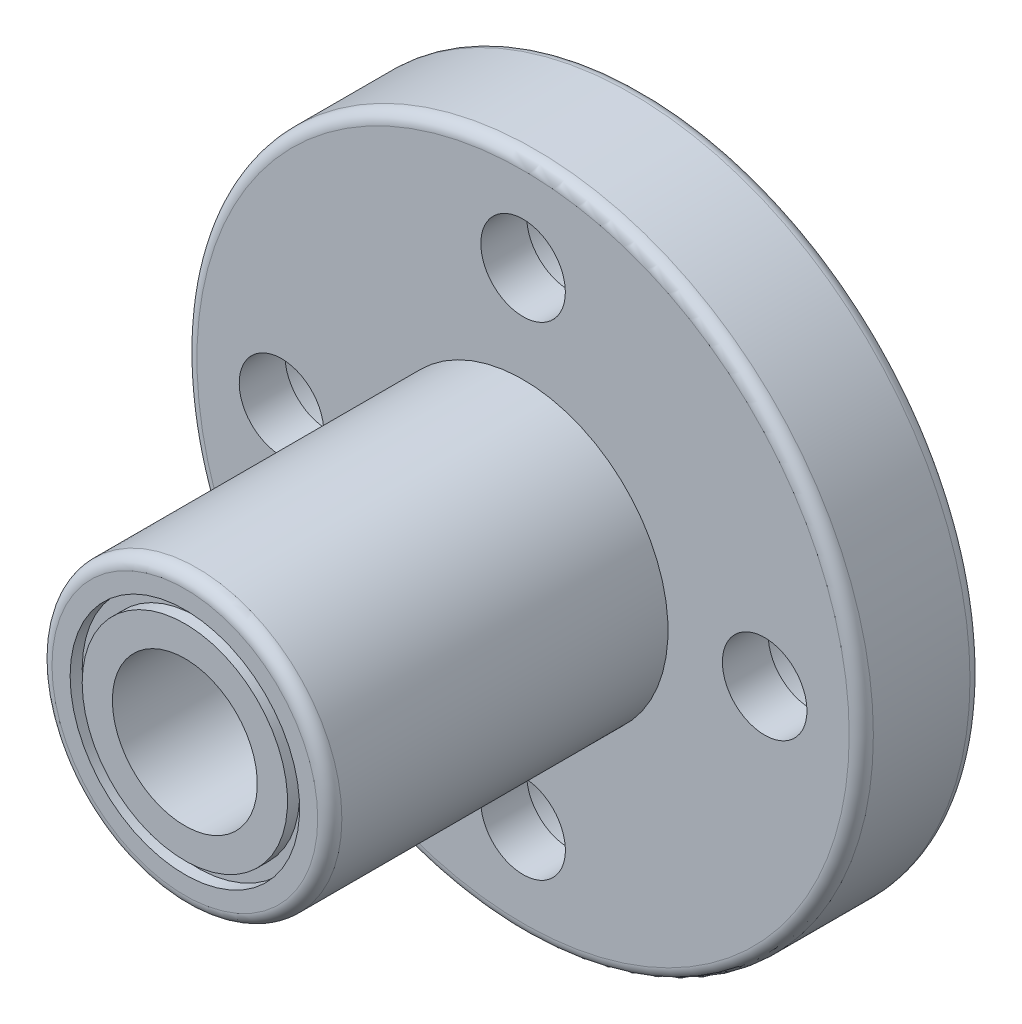
ISO-10303-21;
HEADER;
FILE_DESCRIPTION(('STEP AP214'),'2;1');
FILE_NAME('part.step','',(''),(''),'','','');
FILE_SCHEMA(('AUTOMOTIVE_DESIGN { 1 0 10303 214 1 1 1 1 }'));
ENDSEC;
DATA;
#1=APPLICATION_CONTEXT('core data for automotive mechanical design processes');
#2=APPLICATION_PROTOCOL_DEFINITION('international standard','automotive_design',2000,#1);
#3=PRODUCT_CONTEXT('',#1,'mechanical');
#4=PRODUCT('Part','Part','',(#3));
#5=PRODUCT_RELATED_PRODUCT_CATEGORY('part','',(#4));
#6=PRODUCT_DEFINITION_FORMATION('','',#4);
#7=PRODUCT_DEFINITION_CONTEXT('part definition',#1,'design');
#8=PRODUCT_DEFINITION('design','',#6,#7);
#9=PRODUCT_DEFINITION_SHAPE('','',#8);
#10=(LENGTH_UNIT() NAMED_UNIT(*) SI_UNIT(.MILLI.,.METRE.));
#11=(NAMED_UNIT(*) PLANE_ANGLE_UNIT() SI_UNIT($,.RADIAN.));
#12=(NAMED_UNIT(*) SI_UNIT($,.STERADIAN.) SOLID_ANGLE_UNIT());
#13=UNCERTAINTY_MEASURE_WITH_UNIT(LENGTH_MEASURE(1.E-05),#10,'distance_accuracy_value','');
#14=(GEOMETRIC_REPRESENTATION_CONTEXT(3) GLOBAL_UNCERTAINTY_ASSIGNED_CONTEXT((#13)) GLOBAL_UNIT_ASSIGNED_CONTEXT((#10,
#11,#12)) REPRESENTATION_CONTEXT('',''));
#15=CARTESIAN_POINT('',(0.,0.,0.));
#16=DIRECTION('',(0.,0.,1.));
#17=DIRECTION('',(1.,0.,0.));
#18=AXIS2_PLACEMENT_3D('',#15,#16,#17);
#19=CARTESIAN_POINT('',(0.,-6.,0.));
#20=DIRECTION('',(0.,0.,-1.));
#21=DIRECTION('',(-1.,0.,0.));
#22=AXIS2_PLACEMENT_3D('',#19,#20,#21);
#23=PLANE('',#22);
#24=CARTESIAN_POINT('',(0.,0.,0.));
#25=DIRECTION('',(0.,0.,-1.));
#26=DIRECTION('',(-1.,0.,0.));
#27=AXIS2_PLACEMENT_3D('',#24,#25,#26);
#28=CIRCLE('',#27,13.5);
#29=CARTESIAN_POINT('',(-13.5,0.,0.));
#30=VERTEX_POINT('',#29);
#31=EDGE_CURVE('E71',#30,#30,#28,.T.);
#32=ORIENTED_EDGE('',*,*,#31,.T.);
#33=EDGE_LOOP('',(#32));
#34=FACE_BOUND('',#33,.T.);
#35=CARTESIAN_POINT('',(0.,-10.,0.));
#36=DIRECTION('',(0.,0.,1.));
#37=DIRECTION('',(-1.,0.,0.));
#38=AXIS2_PLACEMENT_3D('',#35,#36,#37);
#39=CIRCLE('',#38,3.);
#40=CARTESIAN_POINT('',(-3.,-10.,0.));
#41=VERTEX_POINT('',#40);
#42=EDGE_CURVE('E165',#41,#41,#39,.T.);
#43=ORIENTED_EDGE('',*,*,#42,.T.);
#44=EDGE_LOOP('',(#43));
#45=FACE_BOUND('',#44,.T.);
#46=CARTESIAN_POINT('',(0.,10.,0.));
#47=DIRECTION('',(0.,0.,1.));
#48=DIRECTION('',(1.,0.,0.));
#49=AXIS2_PLACEMENT_3D('',#46,#47,#48);
#50=CIRCLE('',#49,3.);
#51=CARTESIAN_POINT('',(3.,10.,0.));
#52=VERTEX_POINT('',#51);
#53=EDGE_CURVE('E134',#52,#52,#50,.T.);
#54=ORIENTED_EDGE('',*,*,#53,.T.);
#55=EDGE_LOOP('',(#54));
#56=FACE_BOUND('',#55,.T.);
#57=CARTESIAN_POINT('',(0.,0.,0.));
#58=DIRECTION('',(0.,0.,-1.));
#59=DIRECTION('',(-1.,0.,0.));
#60=AXIS2_PLACEMENT_3D('',#57,#58,#59);
#61=CIRCLE('',#60,6.);
#62=CARTESIAN_POINT('',(-6.,0.,0.));
#63=VERTEX_POINT('',#62);
#64=EDGE_CURVE('E130',#63,#63,#61,.T.);
#65=ORIENTED_EDGE('',*,*,#64,.F.);
#66=EDGE_LOOP('',(#65));
#67=FACE_BOUND('',#66,.T.);
#68=CARTESIAN_POINT('',(10.,0.,0.));
#69=DIRECTION('',(0.,0.,1.));
#70=DIRECTION('',(0.,-1.,0.));
#71=AXIS2_PLACEMENT_3D('',#68,#69,#70);
#72=CIRCLE('',#71,3.);
#73=CARTESIAN_POINT('',(9.99999999999999,-3.00000000000004,0.));
#74=VERTEX_POINT('',#73);
#75=EDGE_CURVE('E149',#74,#74,#72,.T.);
#76=ORIENTED_EDGE('',*,*,#75,.T.);
#77=EDGE_LOOP('',(#76));
#78=FACE_BOUND('',#77,.T.);
#79=CARTESIAN_POINT('',(-10.,1.04744440165294E-13,0.));
#80=DIRECTION('',(0.,0.,1.));
#81=DIRECTION('',(0.,1.,0.));
#82=AXIS2_PLACEMENT_3D('',#79,#80,#81);
#83=CIRCLE('',#82,3.);
#84=CARTESIAN_POINT('',(-9.99999999999997,3.00000000000011,0.));
#85=VERTEX_POINT('',#84);
#86=EDGE_CURVE('E180',#85,#85,#83,.T.);
#87=ORIENTED_EDGE('',*,*,#86,.T.);
#88=EDGE_LOOP('',(#87));
#89=FACE_BOUND('',#88,.T.);
#90=ADVANCED_FACE('F40',(#34,#45,#56,#67,#78,#89),#23,.T.);
#91=CARTESIAN_POINT('',(0.,-14.,5.));
#92=DIRECTION('',(0.,0.,1.));
#93=DIRECTION('',(1.,0.,0.));
#94=AXIS2_PLACEMENT_3D('',#91,#92,#93);
#95=PLANE('',#94);
#96=CARTESIAN_POINT('',(0.,0.,5.));
#97=DIRECTION('',(0.,0.,1.));
#98=DIRECTION('',(1.,0.,0.));
#99=AXIS2_PLACEMENT_3D('',#96,#97,#98);
#100=CIRCLE('',#99,13.5);
#101=CARTESIAN_POINT('',(13.5,0.,5.));
#102=VERTEX_POINT('',#101);
#103=EDGE_CURVE('E55',#102,#102,#100,.T.);
#104=ORIENTED_EDGE('',*,*,#103,.T.);
#105=EDGE_LOOP('',(#104));
#106=FACE_BOUND('',#105,.T.);
#107=CARTESIAN_POINT('',(0.,-10.,5.));
#108=DIRECTION('',(0.,0.,1.));
#109=DIRECTION('',(-1.,0.,0.));
#110=AXIS2_PLACEMENT_3D('',#107,#108,#109);
#111=CIRCLE('',#110,1.75);
#112=CARTESIAN_POINT('',(-1.75,-10.,5.));
#113=VERTEX_POINT('',#112);
#114=EDGE_CURVE('E177',#113,#113,#111,.T.);
#115=ORIENTED_EDGE('',*,*,#114,.F.);
#116=EDGE_LOOP('',(#115));
#117=FACE_BOUND('',#116,.T.);
#118=CARTESIAN_POINT('',(0.,10.,5.));
#119=DIRECTION('',(0.,0.,1.));
#120=DIRECTION('',(1.,0.,0.));
#121=AXIS2_PLACEMENT_3D('',#118,#119,#120);
#122=CIRCLE('',#121,1.75);
#123=CARTESIAN_POINT('',(1.75,10.,5.));
#124=VERTEX_POINT('',#123);
#125=EDGE_CURVE('E145',#124,#124,#122,.T.);
#126=ORIENTED_EDGE('',*,*,#125,.F.);
#127=EDGE_LOOP('',(#126));
#128=FACE_BOUND('',#127,.T.);
#129=CARTESIAN_POINT('',(0.,0.,5.));
#130=DIRECTION('',(0.,0.,-1.));
#131=DIRECTION('',(-1.,0.,0.));
#132=AXIS2_PLACEMENT_3D('',#129,#130,#131);
#133=CIRCLE('',#132,6.);
#134=CARTESIAN_POINT('',(-6.,0.,5.));
#135=VERTEX_POINT('',#134);
#136=EDGE_CURVE('E75',#135,#135,#133,.T.);
#137=ORIENTED_EDGE('',*,*,#136,.T.);
#138=EDGE_LOOP('',(#137));
#139=FACE_BOUND('',#138,.T.);
#140=CARTESIAN_POINT('',(10.,0.,5.));
#141=DIRECTION('',(0.,0.,1.));
#142=DIRECTION('',(0.,-1.,0.));
#143=AXIS2_PLACEMENT_3D('',#140,#141,#142);
#144=CIRCLE('',#143,1.75);
#145=CARTESIAN_POINT('',(9.99999999999999,-1.75000000000003,5.));
#146=VERTEX_POINT('',#145);
#147=EDGE_CURVE('E161',#146,#146,#144,.T.);
#148=ORIENTED_EDGE('',*,*,#147,.F.);
#149=EDGE_LOOP('',(#148));
#150=FACE_BOUND('',#149,.T.);
#151=CARTESIAN_POINT('',(-10.,1.04744440165294E-13,5.));
#152=DIRECTION('',(0.,0.,1.));
#153=DIRECTION('',(0.,1.,0.));
#154=AXIS2_PLACEMENT_3D('',#151,#152,#153);
#155=CIRCLE('',#154,1.75);
#156=CARTESIAN_POINT('',(-9.99999999999998,1.7500000000001,5.));
#157=VERTEX_POINT('',#156);
#158=EDGE_CURVE('E192',#157,#157,#155,.T.);
#159=ORIENTED_EDGE('',*,*,#158,.F.);
#160=EDGE_LOOP('',(#159));
#161=FACE_BOUND('',#160,.T.);
#162=ADVANCED_FACE('F200',(#106,#117,#128,#139,#150,#161),#95,.T.);
#163=CARTESIAN_POINT('',(0.,0.,0.));
#164=DIRECTION('',(0.,0.,-1.));
#165=DIRECTION('',(-1.,0.,0.));
#166=AXIS2_PLACEMENT_3D('',#163,#164,#165);
#167=CYLINDRICAL_SURFACE('',#166,14.);
#168=CARTESIAN_POINT('',(0.,0.,0.5));
#169=DIRECTION('',(0.,0.,-1.));
#170=DIRECTION('',(-1.,0.,0.));
#171=AXIS2_PLACEMENT_3D('',#168,#169,#170);
#172=CIRCLE('',#171,14.);
#173=CARTESIAN_POINT('',(-14.,0.,0.5));
#174=VERTEX_POINT('',#173);
#175=EDGE_CURVE('E61',#174,#174,#172,.F.);
#176=ORIENTED_EDGE('',*,*,#175,.T.);
#177=EDGE_LOOP('',(#176));
#178=FACE_BOUND('',#177,.T.);
#179=CARTESIAN_POINT('',(0.,0.,4.5));
#180=DIRECTION('',(0.,0.,1.));
#181=DIRECTION('',(1.,0.,0.));
#182=AXIS2_PLACEMENT_3D('',#179,#180,#181);
#183=CIRCLE('',#182,14.);
#184=CARTESIAN_POINT('',(14.,0.,4.5));
#185=VERTEX_POINT('',#184);
#186=EDGE_CURVE('E67',#185,#185,#183,.F.);
#187=ORIENTED_EDGE('',*,*,#186,.T.);
#188=EDGE_LOOP('',(#187));
#189=FACE_BOUND('',#188,.T.);
#190=ADVANCED_FACE('F202',(#178,#189),#167,.T.);
#191=CARTESIAN_POINT('',(0.,0.,0.));
#192=DIRECTION('',(0.,0.,-1.));
#193=DIRECTION('',(-1.,0.,0.));
#194=AXIS2_PLACEMENT_3D('',#191,#192,#193);
#195=CYLINDRICAL_SURFACE('',#194,6.);
#196=CARTESIAN_POINT('',(0.,0.,18.5));
#197=DIRECTION('',(0.,0.,1.));
#198=DIRECTION('',(1.,0.,0.));
#199=AXIS2_PLACEMENT_3D('',#196,#197,#198);
#200=CIRCLE('',#199,6.);
#201=CARTESIAN_POINT('',(6.,0.,18.5));
#202=VERTEX_POINT('',#201);
#203=EDGE_CURVE('E48',#202,#202,#200,.F.);
#204=ORIENTED_EDGE('',*,*,#203,.T.);
#205=EDGE_LOOP('',(#204));
#206=FACE_BOUND('',#205,.T.);
#207=ORIENTED_EDGE('',*,*,#136,.F.);
#208=EDGE_LOOP('',(#207));
#209=FACE_BOUND('',#208,.T.);
#210=ADVANCED_FACE('F209',(#206,#209),#195,.T.);
#211=CARTESIAN_POINT('',(0.,-6.,19.));
#212=DIRECTION('',(0.,0.,1.));
#213=DIRECTION('',(1.,0.,0.));
#214=AXIS2_PLACEMENT_3D('',#211,#212,#213);
#215=PLANE('',#214);
#216=CARTESIAN_POINT('',(0.,0.,19.));
#217=DIRECTION('',(0.,0.,1.));
#218=DIRECTION('',(1.,0.,0.));
#219=AXIS2_PLACEMENT_3D('',#216,#217,#218);
#220=CIRCLE('',#219,5.5);
#221=CARTESIAN_POINT('',(5.5,0.,19.));
#222=VERTEX_POINT('',#221);
#223=EDGE_CURVE('E10',#222,#222,#220,.T.);
#224=ORIENTED_EDGE('',*,*,#223,.T.);
#225=EDGE_LOOP('',(#224));
#226=FACE_BOUND('',#225,.T.);
#227=CARTESIAN_POINT('',(0.,0.,19.));
#228=DIRECTION('',(0.,0.,-1.));
#229=DIRECTION('',(-1.,0.,0.));
#230=AXIS2_PLACEMENT_3D('',#227,#228,#229);
#231=CIRCLE('',#230,4.75);
#232=CARTESIAN_POINT('',(-4.75,0.,19.));
#233=VERTEX_POINT('',#232);
#234=EDGE_CURVE('E78',#233,#233,#231,.T.);
#235=ORIENTED_EDGE('',*,*,#234,.T.);
#236=EDGE_LOOP('',(#235));
#237=FACE_BOUND('',#236,.T.);
#238=ADVANCED_FACE('F466',(#226,#237),#215,.T.);
#239=CARTESIAN_POINT('',(0.,0.,0.));
#240=DIRECTION('',(0.,0.,-1.));
#241=DIRECTION('',(-1.,0.,0.));
#242=AXIS2_PLACEMENT_3D('',#239,#240,#241);
#243=CYLINDRICAL_SURFACE('',#242,4.75);
#244=CARTESIAN_POINT('',(0.,0.,18.5));
#245=DIRECTION('',(0.,0.,-1.));
#246=DIRECTION('',(-1.,0.,0.));
#247=AXIS2_PLACEMENT_3D('',#244,#245,#246);
#248=CIRCLE('',#247,4.75);
#249=CARTESIAN_POINT('',(-4.75,0.,18.5));
#250=VERTEX_POINT('',#249);
#251=EDGE_CURVE('E82',#250,#250,#248,.T.);
#252=ORIENTED_EDGE('',*,*,#251,.T.);
#253=EDGE_LOOP('',(#252));
#254=FACE_BOUND('',#253,.T.);
#255=ORIENTED_EDGE('',*,*,#234,.F.);
#256=EDGE_LOOP('',(#255));
#257=FACE_BOUND('',#256,.T.);
#258=ADVANCED_FACE('F457',(#254,#257),#243,.F.);
#259=CARTESIAN_POINT('',(0.,-4.75,18.5));
#260=DIRECTION('',(0.,0.,1.));
#261=DIRECTION('',(1.,0.,0.));
#262=AXIS2_PLACEMENT_3D('',#259,#260,#261);
#263=PLANE('',#262);
#264=CARTESIAN_POINT('',(0.,0.,18.5));
#265=DIRECTION('',(0.,0.,-1.));
#266=DIRECTION('',(-1.,0.,0.));
#267=AXIS2_PLACEMENT_3D('',#264,#265,#266);
#268=CIRCLE('',#267,4.25);
#269=CARTESIAN_POINT('',(-4.25,0.,18.5));
#270=VERTEX_POINT('',#269);
#271=EDGE_CURVE('E86',#270,#270,#268,.T.);
#272=ORIENTED_EDGE('',*,*,#271,.T.);
#273=EDGE_LOOP('',(#272));
#274=FACE_BOUND('',#273,.T.);
#275=ORIENTED_EDGE('',*,*,#251,.F.);
#276=EDGE_LOOP('',(#275));
#277=FACE_BOUND('',#276,.T.);
#278=ADVANCED_FACE('F448',(#274,#277),#263,.T.);
#279=CARTESIAN_POINT('',(0.,0.,0.));
#280=DIRECTION('',(0.,0.,-1.));
#281=DIRECTION('',(-1.,0.,0.));
#282=AXIS2_PLACEMENT_3D('',#279,#280,#281);
#283=CYLINDRICAL_SURFACE('',#282,4.25);
#284=CARTESIAN_POINT('',(0.,0.,19.));
#285=DIRECTION('',(0.,0.,-1.));
#286=DIRECTION('',(-1.,0.,0.));
#287=AXIS2_PLACEMENT_3D('',#284,#285,#286);
#288=CIRCLE('',#287,4.25);
#289=CARTESIAN_POINT('',(-4.25,0.,19.));
#290=VERTEX_POINT('',#289);
#291=EDGE_CURVE('E90',#290,#290,#288,.T.);
#292=ORIENTED_EDGE('',*,*,#291,.T.);
#293=EDGE_LOOP('',(#292));
#294=FACE_BOUND('',#293,.T.);
#295=ORIENTED_EDGE('',*,*,#271,.F.);
#296=EDGE_LOOP('',(#295));
#297=FACE_BOUND('',#296,.T.);
#298=ADVANCED_FACE('F440',(#294,#297),#283,.T.);
#299=CARTESIAN_POINT('',(0.,-4.25,19.));
#300=DIRECTION('',(0.,0.,1.));
#301=DIRECTION('',(1.,0.,0.));
#302=AXIS2_PLACEMENT_3D('',#299,#300,#301);
#303=PLANE('',#302);
#304=CARTESIAN_POINT('',(0.,0.,19.));
#305=DIRECTION('',(0.,0.,-1.));
#306=DIRECTION('',(-1.,0.,0.));
#307=AXIS2_PLACEMENT_3D('',#304,#305,#306);
#308=CIRCLE('',#307,3.);
#309=CARTESIAN_POINT('',(-3.,0.,19.));
#310=VERTEX_POINT('',#309);
#311=EDGE_CURVE('E94',#310,#310,#308,.T.);
#312=ORIENTED_EDGE('',*,*,#311,.T.);
#313=EDGE_LOOP('',(#312));
#314=FACE_BOUND('',#313,.T.);
#315=ORIENTED_EDGE('',*,*,#291,.F.);
#316=EDGE_LOOP('',(#315));
#317=FACE_BOUND('',#316,.T.);
#318=ADVANCED_FACE('F432',(#314,#317),#303,.T.);
#319=CARTESIAN_POINT('',(0.,0.,0.));
#320=DIRECTION('',(0.,0.,-1.));
#321=DIRECTION('',(-1.,0.,0.));
#322=AXIS2_PLACEMENT_3D('',#319,#320,#321);
#323=CYLINDRICAL_SURFACE('',#322,3.);
#324=CARTESIAN_POINT('',(0.,0.,0.));
#325=DIRECTION('',(0.,0.,-1.));
#326=DIRECTION('',(-1.,0.,0.));
#327=AXIS2_PLACEMENT_3D('',#324,#325,#326);
#328=CIRCLE('',#327,3.);
#329=CARTESIAN_POINT('',(-3.,0.,0.));
#330=VERTEX_POINT('',#329);
#331=EDGE_CURVE('E98',#330,#330,#328,.T.);
#332=ORIENTED_EDGE('',*,*,#331,.T.);
#333=EDGE_LOOP('',(#332));
#334=FACE_BOUND('',#333,.T.);
#335=ORIENTED_EDGE('',*,*,#311,.F.);
#336=EDGE_LOOP('',(#335));
#337=FACE_BOUND('',#336,.T.);
#338=ADVANCED_FACE('F423',(#334,#337),#323,.F.);
#339=CARTESIAN_POINT('',(0.,-3.,0.));
#340=DIRECTION('',(0.,0.,-1.));
#341=DIRECTION('',(-1.,0.,0.));
#342=AXIS2_PLACEMENT_3D('',#339,#340,#341);
#343=PLANE('',#342);
#344=CARTESIAN_POINT('',(0.,0.,0.));
#345=DIRECTION('',(0.,0.,-1.));
#346=DIRECTION('',(-1.,0.,0.));
#347=AXIS2_PLACEMENT_3D('',#344,#345,#346);
#348=CIRCLE('',#347,4.25);
#349=CARTESIAN_POINT('',(-4.25,0.,0.));
#350=VERTEX_POINT('',#349);
#351=EDGE_CURVE('E102',#350,#350,#348,.T.);
#352=ORIENTED_EDGE('',*,*,#351,.T.);
#353=EDGE_LOOP('',(#352));
#354=FACE_BOUND('',#353,.T.);
#355=ORIENTED_EDGE('',*,*,#331,.F.);
#356=EDGE_LOOP('',(#355));
#357=FACE_BOUND('',#356,.T.);
#358=ADVANCED_FACE('F414',(#354,#357),#343,.T.);
#359=CARTESIAN_POINT('',(0.,0.,0.));
#360=DIRECTION('',(0.,0.,-1.));
#361=DIRECTION('',(-1.,0.,0.));
#362=AXIS2_PLACEMENT_3D('',#359,#360,#361);
#363=CYLINDRICAL_SURFACE('',#362,4.25);
#364=CARTESIAN_POINT('',(0.,0.,0.5));
#365=DIRECTION('',(0.,0.,-1.));
#366=DIRECTION('',(-1.,0.,0.));
#367=AXIS2_PLACEMENT_3D('',#364,#365,#366);
#368=CIRCLE('',#367,4.25);
#369=CARTESIAN_POINT('',(-4.25,0.,0.5));
#370=VERTEX_POINT('',#369);
#371=EDGE_CURVE('E106',#370,#370,#368,.T.);
#372=ORIENTED_EDGE('',*,*,#371,.T.);
#373=EDGE_LOOP('',(#372));
#374=FACE_BOUND('',#373,.T.);
#375=ORIENTED_EDGE('',*,*,#351,.F.);
#376=EDGE_LOOP('',(#375));
#377=FACE_BOUND('',#376,.T.);
#378=ADVANCED_FACE('F405',(#374,#377),#363,.T.);
#379=CARTESIAN_POINT('',(0.,-4.75,0.5));
#380=DIRECTION('',(0.,0.,-1.));
#381=DIRECTION('',(-1.,0.,0.));
#382=AXIS2_PLACEMENT_3D('',#379,#380,#381);
#383=PLANE('',#382);
#384=CARTESIAN_POINT('',(0.,0.,0.5));
#385=DIRECTION('',(0.,0.,-1.));
#386=DIRECTION('',(-1.,0.,0.));
#387=AXIS2_PLACEMENT_3D('',#384,#385,#386);
#388=CIRCLE('',#387,4.75);
#389=CARTESIAN_POINT('',(-4.75,0.,0.5));
#390=VERTEX_POINT('',#389);
#391=EDGE_CURVE('E110',#390,#390,#388,.T.);
#392=ORIENTED_EDGE('',*,*,#391,.T.);
#393=EDGE_LOOP('',(#392));
#394=FACE_BOUND('',#393,.T.);
#395=ORIENTED_EDGE('',*,*,#371,.F.);
#396=EDGE_LOOP('',(#395));
#397=FACE_BOUND('',#396,.T.);
#398=ADVANCED_FACE('F396',(#394,#397),#383,.T.);
#399=CARTESIAN_POINT('',(0.,0.,0.));
#400=DIRECTION('',(0.,0.,-1.));
#401=DIRECTION('',(-1.,0.,0.));
#402=AXIS2_PLACEMENT_3D('',#399,#400,#401);
#403=CYLINDRICAL_SURFACE('',#402,4.75);
#404=CARTESIAN_POINT('',(0.,0.,0.));
#405=DIRECTION('',(0.,0.,-1.));
#406=DIRECTION('',(-1.,0.,0.));
#407=AXIS2_PLACEMENT_3D('',#404,#405,#406);
#408=CIRCLE('',#407,4.75);
#409=CARTESIAN_POINT('',(-4.75,0.,0.));
#410=VERTEX_POINT('',#409);
#411=EDGE_CURVE('E114',#410,#410,#408,.T.);
#412=ORIENTED_EDGE('',*,*,#411,.T.);
#413=EDGE_LOOP('',(#412));
#414=FACE_BOUND('',#413,.T.);
#415=ORIENTED_EDGE('',*,*,#391,.F.);
#416=EDGE_LOOP('',(#415));
#417=FACE_BOUND('',#416,.T.);
#418=ADVANCED_FACE('F387',(#414,#417),#403,.F.);
#419=CARTESIAN_POINT('',(0.,-4.75,0.));
#420=DIRECTION('',(0.,0.,-1.));
#421=DIRECTION('',(-1.,0.,0.));
#422=AXIS2_PLACEMENT_3D('',#419,#420,#421);
#423=PLANE('',#422);
#424=CARTESIAN_POINT('',(0.,0.,0.));
#425=DIRECTION('',(0.,0.,-1.));
#426=DIRECTION('',(-1.,0.,0.));
#427=AXIS2_PLACEMENT_3D('',#424,#425,#426);
#428=CIRCLE('',#427,5.5);
#429=CARTESIAN_POINT('',(-5.5,0.,0.));
#430=VERTEX_POINT('',#429);
#431=EDGE_CURVE('E118',#430,#430,#428,.T.);
#432=ORIENTED_EDGE('',*,*,#431,.T.);
#433=EDGE_LOOP('',(#432));
#434=FACE_BOUND('',#433,.T.);
#435=ORIENTED_EDGE('',*,*,#411,.F.);
#436=EDGE_LOOP('',(#435));
#437=FACE_BOUND('',#436,.T.);
#438=ADVANCED_FACE('F378',(#434,#437),#423,.T.);
#439=CARTESIAN_POINT('',(0.,0.,0.));
#440=DIRECTION('',(0.,0.,-1.));
#441=DIRECTION('',(-1.,0.,0.));
#442=AXIS2_PLACEMENT_3D('',#439,#440,#441);
#443=CYLINDRICAL_SURFACE('',#442,5.5);
#444=CARTESIAN_POINT('',(0.,0.,0.499999999999999));
#445=DIRECTION('',(0.,0.,-1.));
#446=DIRECTION('',(-1.,0.,0.));
#447=AXIS2_PLACEMENT_3D('',#444,#445,#446);
#448=CIRCLE('',#447,5.5);
#449=CARTESIAN_POINT('',(-5.5,0.,0.499999999999999));
#450=VERTEX_POINT('',#449);
#451=EDGE_CURVE('E122',#450,#450,#448,.T.);
#452=ORIENTED_EDGE('',*,*,#451,.T.);
#453=EDGE_LOOP('',(#452));
#454=FACE_BOUND('',#453,.T.);
#455=ORIENTED_EDGE('',*,*,#431,.F.);
#456=EDGE_LOOP('',(#455));
#457=FACE_BOUND('',#456,.T.);
#458=ADVANCED_FACE('F369',(#454,#457),#443,.T.);
#459=CARTESIAN_POINT('',(0.,-6.,0.5));
#460=DIRECTION('',(0.,0.,-1.));
#461=DIRECTION('',(-1.,0.,0.));
#462=AXIS2_PLACEMENT_3D('',#459,#460,#461);
#463=PLANE('',#462);
#464=CARTESIAN_POINT('',(0.,0.,0.5));
#465=DIRECTION('',(0.,0.,-1.));
#466=DIRECTION('',(-1.,0.,0.));
#467=AXIS2_PLACEMENT_3D('',#464,#465,#466);
#468=CIRCLE('',#467,6.);
#469=CARTESIAN_POINT('',(-6.,0.,0.5));
#470=VERTEX_POINT('',#469);
#471=EDGE_CURVE('E126',#470,#470,#468,.T.);
#472=ORIENTED_EDGE('',*,*,#471,.T.);
#473=EDGE_LOOP('',(#472));
#474=FACE_BOUND('',#473,.T.);
#475=ORIENTED_EDGE('',*,*,#451,.F.);
#476=EDGE_LOOP('',(#475));
#477=FACE_BOUND('',#476,.T.);
#478=ADVANCED_FACE('F360',(#474,#477),#463,.T.);
#479=CARTESIAN_POINT('',(0.,0.,0.));
#480=DIRECTION('',(0.,0.,-1.));
#481=DIRECTION('',(-1.,0.,0.));
#482=AXIS2_PLACEMENT_3D('',#479,#480,#481);
#483=CYLINDRICAL_SURFACE('',#482,6.);
#484=ORIENTED_EDGE('',*,*,#64,.T.);
#485=EDGE_LOOP('',(#484));
#486=FACE_BOUND('',#485,.T.);
#487=ORIENTED_EDGE('',*,*,#471,.F.);
#488=EDGE_LOOP('',(#487));
#489=FACE_BOUND('',#488,.T.);
#490=ADVANCED_FACE('F351',(#486,#489),#483,.F.);
#491=CARTESIAN_POINT('',(0.,10.,0.));
#492=DIRECTION('',(0.,0.,1.));
#493=DIRECTION('',(1.,0.,0.));
#494=AXIS2_PLACEMENT_3D('',#491,#492,#493);
#495=CYLINDRICAL_SURFACE('',#494,3.);
#496=CARTESIAN_POINT('',(0.,10.,3.1));
#497=DIRECTION('',(0.,0.,1.));
#498=DIRECTION('',(1.,0.,0.));
#499=AXIS2_PLACEMENT_3D('',#496,#497,#498);
#500=CIRCLE('',#499,3.);
#501=CARTESIAN_POINT('',(3.,10.,3.1));
#502=VERTEX_POINT('',#501);
#503=EDGE_CURVE('E138',#502,#502,#500,.T.);
#504=ORIENTED_EDGE('',*,*,#503,.T.);
#505=EDGE_LOOP('',(#504));
#506=FACE_BOUND('',#505,.T.);
#507=ORIENTED_EDGE('',*,*,#53,.F.);
#508=EDGE_LOOP('',(#507));
#509=FACE_BOUND('',#508,.T.);
#510=ADVANCED_FACE('F342',(#506,#509),#495,.F.);
#511=CARTESIAN_POINT('',(0.,13.,3.1));
#512=DIRECTION('',(0.,0.,-1.));
#513=DIRECTION('',(-1.,0.,0.));
#514=AXIS2_PLACEMENT_3D('',#511,#512,#513);
#515=PLANE('',#514);
#516=CARTESIAN_POINT('',(0.,10.,3.1));
#517=DIRECTION('',(0.,0.,1.));
#518=DIRECTION('',(1.,0.,0.));
#519=AXIS2_PLACEMENT_3D('',#516,#517,#518);
#520=CIRCLE('',#519,1.75);
#521=CARTESIAN_POINT('',(1.75,10.,3.1));
#522=VERTEX_POINT('',#521);
#523=EDGE_CURVE('E141',#522,#522,#520,.T.);
#524=ORIENTED_EDGE('',*,*,#523,.T.);
#525=EDGE_LOOP('',(#524));
#526=FACE_BOUND('',#525,.T.);
#527=ORIENTED_EDGE('',*,*,#503,.F.);
#528=EDGE_LOOP('',(#527));
#529=FACE_BOUND('',#528,.T.);
#530=ADVANCED_FACE('F333',(#526,#529),#515,.T.);
#531=CARTESIAN_POINT('',(0.,10.,0.));
#532=DIRECTION('',(0.,0.,1.));
#533=DIRECTION('',(1.,0.,0.));
#534=AXIS2_PLACEMENT_3D('',#531,#532,#533);
#535=CYLINDRICAL_SURFACE('',#534,1.75);
#536=ORIENTED_EDGE('',*,*,#125,.T.);
#537=EDGE_LOOP('',(#536));
#538=FACE_BOUND('',#537,.T.);
#539=ORIENTED_EDGE('',*,*,#523,.F.);
#540=EDGE_LOOP('',(#539));
#541=FACE_BOUND('',#540,.T.);
#542=ADVANCED_FACE('F324',(#538,#541),#535,.F.);
#543=CARTESIAN_POINT('',(10.,0.,0.));
#544=DIRECTION('',(0.,0.,1.));
#545=DIRECTION('',(0.,-1.,0.));
#546=AXIS2_PLACEMENT_3D('',#543,#544,#545);
#547=CYLINDRICAL_SURFACE('',#546,3.);
#548=CARTESIAN_POINT('',(10.,0.,3.1));
#549=DIRECTION('',(0.,0.,1.));
#550=DIRECTION('',(0.,-1.,0.));
#551=AXIS2_PLACEMENT_3D('',#548,#549,#550);
#552=CIRCLE('',#551,3.);
#553=CARTESIAN_POINT('',(9.99999999999999,-3.00000000000004,3.1));
#554=VERTEX_POINT('',#553);
#555=EDGE_CURVE('E153',#554,#554,#552,.T.);
#556=ORIENTED_EDGE('',*,*,#555,.T.);
#557=EDGE_LOOP('',(#556));
#558=FACE_BOUND('',#557,.T.);
#559=ORIENTED_EDGE('',*,*,#75,.F.);
#560=EDGE_LOOP('',(#559));
#561=FACE_BOUND('',#560,.T.);
#562=ADVANCED_FACE('F315',(#558,#561),#547,.F.);
#563=CARTESIAN_POINT('',(13.,0.,3.1));
#564=DIRECTION('',(0.,0.,-1.));
#565=DIRECTION('',(0.,1.,0.));
#566=AXIS2_PLACEMENT_3D('',#563,#564,#565);
#567=PLANE('',#566);
#568=CARTESIAN_POINT('',(10.,0.,3.1));
#569=DIRECTION('',(0.,0.,1.));
#570=DIRECTION('',(0.,-1.,0.));
#571=AXIS2_PLACEMENT_3D('',#568,#569,#570);
#572=CIRCLE('',#571,1.75);
#573=CARTESIAN_POINT('',(9.99999999999999,-1.75000000000003,3.1));
#574=VERTEX_POINT('',#573);
#575=EDGE_CURVE('E157',#574,#574,#572,.T.);
#576=ORIENTED_EDGE('',*,*,#575,.T.);
#577=EDGE_LOOP('',(#576));
#578=FACE_BOUND('',#577,.T.);
#579=ORIENTED_EDGE('',*,*,#555,.F.);
#580=EDGE_LOOP('',(#579));
#581=FACE_BOUND('',#580,.T.);
#582=ADVANCED_FACE('F306',(#578,#581),#567,.T.);
#583=CARTESIAN_POINT('',(10.,0.,0.));
#584=DIRECTION('',(0.,0.,1.));
#585=DIRECTION('',(0.,-1.,0.));
#586=AXIS2_PLACEMENT_3D('',#583,#584,#585);
#587=CYLINDRICAL_SURFACE('',#586,1.75);
#588=ORIENTED_EDGE('',*,*,#147,.T.);
#589=EDGE_LOOP('',(#588));
#590=FACE_BOUND('',#589,.T.);
#591=ORIENTED_EDGE('',*,*,#575,.F.);
#592=EDGE_LOOP('',(#591));
#593=FACE_BOUND('',#592,.T.);
#594=ADVANCED_FACE('F298',(#590,#593),#587,.F.);
#595=CARTESIAN_POINT('',(0.,-10.,0.));
#596=DIRECTION('',(0.,0.,1.));
#597=DIRECTION('',(-1.,0.,0.));
#598=AXIS2_PLACEMENT_3D('',#595,#596,#597);
#599=CYLINDRICAL_SURFACE('',#598,3.);
#600=CARTESIAN_POINT('',(0.,-10.,3.1));
#601=DIRECTION('',(0.,0.,1.));
#602=DIRECTION('',(-1.,0.,0.));
#603=AXIS2_PLACEMENT_3D('',#600,#601,#602);
#604=CIRCLE('',#603,3.);
#605=CARTESIAN_POINT('',(-3.,-10.,3.1));
#606=VERTEX_POINT('',#605);
#607=EDGE_CURVE('E169',#606,#606,#604,.T.);
#608=ORIENTED_EDGE('',*,*,#607,.T.);
#609=EDGE_LOOP('',(#608));
#610=FACE_BOUND('',#609,.T.);
#611=ORIENTED_EDGE('',*,*,#42,.F.);
#612=EDGE_LOOP('',(#611));
#613=FACE_BOUND('',#612,.T.);
#614=ADVANCED_FACE('F289',(#610,#613),#599,.F.);
#615=CARTESIAN_POINT('',(0.,-13.,3.1));
#616=DIRECTION('',(0.,0.,-1.));
#617=DIRECTION('',(1.,0.,0.));
#618=AXIS2_PLACEMENT_3D('',#615,#616,#617);
#619=PLANE('',#618);
#620=CARTESIAN_POINT('',(0.,-10.,3.1));
#621=DIRECTION('',(0.,0.,1.));
#622=DIRECTION('',(-1.,0.,0.));
#623=AXIS2_PLACEMENT_3D('',#620,#621,#622);
#624=CIRCLE('',#623,1.75);
#625=CARTESIAN_POINT('',(-1.75,-10.,3.1));
#626=VERTEX_POINT('',#625);
#627=EDGE_CURVE('E173',#626,#626,#624,.T.);
#628=ORIENTED_EDGE('',*,*,#627,.T.);
#629=EDGE_LOOP('',(#628));
#630=FACE_BOUND('',#629,.T.);
#631=ORIENTED_EDGE('',*,*,#607,.F.);
#632=EDGE_LOOP('',(#631));
#633=FACE_BOUND('',#632,.T.);
#634=ADVANCED_FACE('F280',(#630,#633),#619,.T.);
#635=CARTESIAN_POINT('',(0.,-10.,0.));
#636=DIRECTION('',(0.,0.,1.));
#637=DIRECTION('',(-1.,0.,0.));
#638=AXIS2_PLACEMENT_3D('',#635,#636,#637);
#639=CYLINDRICAL_SURFACE('',#638,1.75);
#640=ORIENTED_EDGE('',*,*,#114,.T.);
#641=EDGE_LOOP('',(#640));
#642=FACE_BOUND('',#641,.T.);
#643=ORIENTED_EDGE('',*,*,#627,.F.);
#644=EDGE_LOOP('',(#643));
#645=FACE_BOUND('',#644,.T.);
#646=ADVANCED_FACE('F270',(#642,#645),#639,.F.);
#647=CARTESIAN_POINT('',(-10.,1.04744440165294E-13,0.));
#648=DIRECTION('',(0.,0.,1.));
#649=DIRECTION('',(0.,1.,0.));
#650=AXIS2_PLACEMENT_3D('',#647,#648,#649);
#651=CYLINDRICAL_SURFACE('',#650,3.);
#652=CARTESIAN_POINT('',(-10.,1.04744440165294E-13,3.1));
#653=DIRECTION('',(0.,0.,1.));
#654=DIRECTION('',(0.,1.,0.));
#655=AXIS2_PLACEMENT_3D('',#652,#653,#654);
#656=CIRCLE('',#655,3.);
#657=CARTESIAN_POINT('',(-9.99999999999997,3.00000000000011,3.1));
#658=VERTEX_POINT('',#657);
#659=EDGE_CURVE('E184',#658,#658,#656,.T.);
#660=ORIENTED_EDGE('',*,*,#659,.T.);
#661=EDGE_LOOP('',(#660));
#662=FACE_BOUND('',#661,.T.);
#663=ORIENTED_EDGE('',*,*,#86,.F.);
#664=EDGE_LOOP('',(#663));
#665=FACE_BOUND('',#664,.T.);
#666=ADVANCED_FACE('F260',(#662,#665),#651,.F.);
#667=CARTESIAN_POINT('',(-13.,1.36167772214882E-13,3.1));
#668=DIRECTION('',(0.,0.,-1.));
#669=DIRECTION('',(0.,-1.,0.));
#670=AXIS2_PLACEMENT_3D('',#667,#668,#669);
#671=PLANE('',#670);
#672=CARTESIAN_POINT('',(-10.,1.04744440165294E-13,3.1));
#673=DIRECTION('',(0.,0.,1.));
#674=DIRECTION('',(0.,1.,0.));
#675=AXIS2_PLACEMENT_3D('',#672,#673,#674);
#676=CIRCLE('',#675,1.75);
#677=CARTESIAN_POINT('',(-9.99999999999998,1.7500000000001,3.1));
#678=VERTEX_POINT('',#677);
#679=EDGE_CURVE('E188',#678,#678,#676,.T.);
#680=ORIENTED_EDGE('',*,*,#679,.T.);
#681=EDGE_LOOP('',(#680));
#682=FACE_BOUND('',#681,.T.);
#683=ORIENTED_EDGE('',*,*,#659,.F.);
#684=EDGE_LOOP('',(#683));
#685=FACE_BOUND('',#684,.T.);
#686=ADVANCED_FACE('F251',(#682,#685),#671,.T.);
#687=CARTESIAN_POINT('',(-10.,1.04744440165294E-13,0.));
#688=DIRECTION('',(0.,0.,1.));
#689=DIRECTION('',(0.,1.,0.));
#690=AXIS2_PLACEMENT_3D('',#687,#688,#689);
#691=CYLINDRICAL_SURFACE('',#690,1.75);
#692=ORIENTED_EDGE('',*,*,#158,.T.);
#693=EDGE_LOOP('',(#692));
#694=FACE_BOUND('',#693,.T.);
#695=ORIENTED_EDGE('',*,*,#679,.F.);
#696=EDGE_LOOP('',(#695));
#697=FACE_BOUND('',#696,.T.);
#698=ADVANCED_FACE('F197',(#694,#697),#691,.F.);
#699=CARTESIAN_POINT('',(0.,0.,0.5));
#700=DIRECTION('',(0.,0.,-1.));
#701=DIRECTION('',(-1.,0.,0.));
#702=AXIS2_PLACEMENT_3D('',#699,#700,#701);
#703=TOROIDAL_SURFACE('',#702,13.5,0.5);
#704=ORIENTED_EDGE('',*,*,#175,.F.);
#705=EDGE_LOOP('',(#704));
#706=FACE_BOUND('',#705,.T.);
#707=ORIENTED_EDGE('',*,*,#31,.F.);
#708=EDGE_LOOP('',(#707));
#709=FACE_BOUND('',#708,.T.);
#710=ADVANCED_FACE('F218',(#706,#709),#703,.T.);
#711=CARTESIAN_POINT('',(0.,0.,4.5));
#712=DIRECTION('',(0.,0.,1.));
#713=DIRECTION('',(1.,0.,0.));
#714=AXIS2_PLACEMENT_3D('',#711,#712,#713);
#715=TOROIDAL_SURFACE('',#714,13.5,0.5);
#716=ORIENTED_EDGE('',*,*,#103,.F.);
#717=EDGE_LOOP('',(#716));
#718=FACE_BOUND('',#717,.T.);
#719=ORIENTED_EDGE('',*,*,#186,.F.);
#720=EDGE_LOOP('',(#719));
#721=FACE_BOUND('',#720,.T.);
#722=ADVANCED_FACE('F220',(#718,#721),#715,.T.);
#723=CARTESIAN_POINT('',(0.,0.,18.5));
#724=DIRECTION('',(0.,0.,1.));
#725=DIRECTION('',(1.,0.,0.));
#726=AXIS2_PLACEMENT_3D('',#723,#724,#725);
#727=TOROIDAL_SURFACE('',#726,5.5,0.5);
#728=ORIENTED_EDGE('',*,*,#223,.F.);
#729=EDGE_LOOP('',(#728));
#730=FACE_BOUND('',#729,.T.);
#731=ORIENTED_EDGE('',*,*,#203,.F.);
#732=EDGE_LOOP('',(#731));
#733=FACE_BOUND('',#732,.T.);
#734=ADVANCED_FACE('F42',(#730,#733),#727,.T.);
#735=CLOSED_SHELL('',(#90,#162,#190,#210,#238,#258,#278,#298,#318,#338,#358,#378,#398,#418,#438,
#458,#478,#490,#510,#530,#542,#562,#582,#594,#614,#634,#646,#666,#686,#698,#710,#722,#734));
#736=MANIFOLD_SOLID_BREP('B2',#735);
#737=ADVANCED_BREP_SHAPE_REPRESENTATION('',(#18,#736),#14);
#738=SHAPE_DEFINITION_REPRESENTATION(#9,#737);
ENDSEC;
END-ISO-10303-21;
